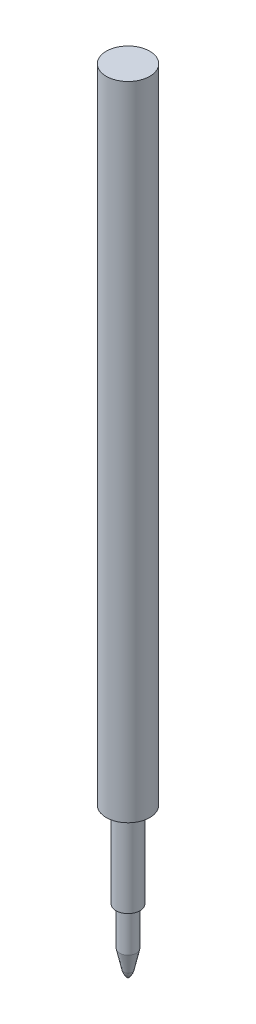
ISO-10303-21;
HEADER;
FILE_DESCRIPTION(('STEP AP214'),'2;1');
FILE_NAME('part.step','',(''),(''),'','','');
FILE_SCHEMA(('AUTOMOTIVE_DESIGN { 1 0 10303 214 1 1 1 1 }'));
ENDSEC;
DATA;
#1=APPLICATION_CONTEXT('core data for automotive mechanical design processes');
#2=APPLICATION_PROTOCOL_DEFINITION('international standard','automotive_design',2000,#1);
#3=PRODUCT_CONTEXT('',#1,'mechanical');
#4=PRODUCT('Part','Part','',(#3));
#5=PRODUCT_RELATED_PRODUCT_CATEGORY('part','',(#4));
#6=PRODUCT_DEFINITION_FORMATION('','',#4);
#7=PRODUCT_DEFINITION_CONTEXT('part definition',#1,'design');
#8=PRODUCT_DEFINITION('design','',#6,#7);
#9=PRODUCT_DEFINITION_SHAPE('','',#8);
#10=(LENGTH_UNIT() NAMED_UNIT(*) SI_UNIT(.MILLI.,.METRE.));
#11=(NAMED_UNIT(*) PLANE_ANGLE_UNIT() SI_UNIT($,.RADIAN.));
#12=(NAMED_UNIT(*) SI_UNIT($,.STERADIAN.) SOLID_ANGLE_UNIT());
#13=UNCERTAINTY_MEASURE_WITH_UNIT(LENGTH_MEASURE(1.E-05),#10,'distance_accuracy_value','');
#14=(GEOMETRIC_REPRESENTATION_CONTEXT(3) GLOBAL_UNCERTAINTY_ASSIGNED_CONTEXT((#13)) GLOBAL_UNIT_ASSIGNED_CONTEXT((#10,
#11,#12)) REPRESENTATION_CONTEXT('',''));
#15=CARTESIAN_POINT('',(0.,0.,0.));
#16=DIRECTION('',(0.,0.,1.));
#17=DIRECTION('',(1.,0.,0.));
#18=AXIS2_PLACEMENT_3D('',#15,#16,#17);
#19=CARTESIAN_POINT('',(0.,1.39695431472081,1.19492385786802));
#20=DIRECTION('',(1.,0.,0.));
#21=DIRECTION('',(0.,0.,-1.));
#22=AXIS2_PLACEMENT_3D('',#19,#20,#21);
#23=CIRCLE('',#22,1.83829387844253);
#24=TRIMMED_CURVE('',#23,(PARAMETER_VALUE(-0.863188384254125)),
(PARAMETER_VALUE(0.863188384254125)),.T.,.PARAMETER.);
#25=CARTESIAN_POINT('',(0.,1.39695431472081,0.));
#26=DIRECTION('',(0.,-1.,0.));
#27=AXIS1_PLACEMENT('',#25,#26);
#28=SURFACE_OF_REVOLUTION('',#24,#27);
#29=CARTESIAN_POINT('',(0.,0.999999999976353,0.));
#30=DIRECTION('',(0.,1.,0.));
#31=DIRECTION('',(0.,0.,1.));
#32=AXIS2_PLACEMENT_3D('',#29,#30,#31);
#33=CIRCLE('',#32,0.600000000005707);
#34=CARTESIAN_POINT('',(0.,0.999999999976353,0.600000000005707));
#35=VERTEX_POINT('',#34);
#36=EDGE_CURVE('E73',#35,#35,#33,.T.);
#37=ORIENTED_EDGE('',*,*,#36,.F.);
#38=EDGE_LOOP('',(#37));
#39=FACE_BOUND('',#38,.T.);
#40=CARTESIAN_POINT('',(0.,0.,0.));
#41=VERTEX_POINT('',#40);
#42=VERTEX_LOOP('',#41);
#43=FACE_BOUND('',#42,.T.);
#44=ADVANCED_FACE('F16',(#39,#43),#28,.F.);
#45=CARTESIAN_POINT('',(0.,3.60000000000582,0.));
#46=DIRECTION('',(0.,1.,0.));
#47=DIRECTION('',(0.,0.,1.));
#48=AXIS2_PLACEMENT_3D('',#45,#46,#47);
#49=CONICAL_SURFACE('',#48,1.17500000001769,0.217650616289047);
#50=ORIENTED_EDGE('',*,*,#36,.T.);
#51=EDGE_LOOP('',(#50));
#52=FACE_BOUND('',#51,.T.);
#53=CARTESIAN_POINT('',(0.,3.6,0.));
#54=DIRECTION('',(0.,-1.,0.));
#55=DIRECTION('',(0.,0.,-1.));
#56=AXIS2_PLACEMENT_3D('',#53,#54,#55);
#57=CIRCLE('',#56,1.175);
#58=CARTESIAN_POINT('',(0.,3.6,-1.175));
#59=VERTEX_POINT('',#58);
#60=EDGE_CURVE('E71',#59,#59,#57,.F.);
#61=ORIENTED_EDGE('',*,*,#60,.F.);
#62=EDGE_LOOP('',(#61));
#63=FACE_BOUND('',#62,.T.);
#64=ADVANCED_FACE('F29',(#52,#63),#49,.T.);
#65=CARTESIAN_POINT('',(0.,0.,0.));
#66=DIRECTION('',(0.,-1.,0.));
#67=DIRECTION('',(0.,0.,-1.));
#68=AXIS2_PLACEMENT_3D('',#65,#66,#67);
#69=CYLINDRICAL_SURFACE('',#68,1.175);
#70=CARTESIAN_POINT('',(0.,9.00000000000001,0.));
#71=DIRECTION('',(0.,-1.,0.));
#72=DIRECTION('',(0.,0.,-1.));
#73=AXIS2_PLACEMENT_3D('',#70,#71,#72);
#74=CIRCLE('',#73,1.175);
#75=CARTESIAN_POINT('',(0.,9.00000000000001,-1.175));
#76=VERTEX_POINT('',#75);
#77=EDGE_CURVE('E20',#76,#76,#74,.F.);
#78=ORIENTED_EDGE('',*,*,#77,.F.);
#79=EDGE_LOOP('',(#78));
#80=FACE_BOUND('',#79,.T.);
#81=ORIENTED_EDGE('',*,*,#60,.T.);
#82=EDGE_LOOP('',(#81));
#83=FACE_BOUND('',#82,.T.);
#84=ADVANCED_FACE('F35',(#80,#83),#69,.T.);
#85=CARTESIAN_POINT('',(1.675,9.00000000000001,0.));
#86=DIRECTION('',(0.,-1.,0.));
#87=DIRECTION('',(0.,0.,-1.));
#88=AXIS2_PLACEMENT_3D('',#85,#86,#87);
#89=PLANE('',#88);
#90=ORIENTED_EDGE('',*,*,#77,.T.);
#91=EDGE_LOOP('',(#90));
#92=FACE_BOUND('',#91,.T.);
#93=CARTESIAN_POINT('',(0.,9.00000000000001,0.));
#94=DIRECTION('',(0.,-1.,0.));
#95=DIRECTION('',(0.,0.,-1.));
#96=AXIS2_PLACEMENT_3D('',#93,#94,#95);
#97=CIRCLE('',#96,1.675);
#98=CARTESIAN_POINT('',(0.,9.00000000000001,-1.675));
#99=VERTEX_POINT('',#98);
#100=EDGE_CURVE('E75',#99,#99,#97,.F.);
#101=ORIENTED_EDGE('',*,*,#100,.F.);
#102=EDGE_LOOP('',(#101));
#103=FACE_BOUND('',#102,.T.);
#104=ADVANCED_FACE('F57',(#92,#103),#89,.T.);
#105=CARTESIAN_POINT('',(0.,0.,0.));
#106=DIRECTION('',(0.,-1.,0.));
#107=DIRECTION('',(0.,0.,-1.));
#108=AXIS2_PLACEMENT_3D('',#105,#106,#107);
#109=CYLINDRICAL_SURFACE('',#108,1.675);
#110=CARTESIAN_POINT('',(0.,21.,0.));
#111=DIRECTION('',(0.,-1.,0.));
#112=DIRECTION('',(0.,0.,-1.));
#113=AXIS2_PLACEMENT_3D('',#110,#111,#112);
#114=CIRCLE('',#113,1.675);
#115=CARTESIAN_POINT('',(0.,21.,-1.675));
#116=VERTEX_POINT('',#115);
#117=EDGE_CURVE('E82',#116,#116,#114,.F.);
#118=ORIENTED_EDGE('',*,*,#117,.F.);
#119=EDGE_LOOP('',(#118));
#120=FACE_BOUND('',#119,.T.);
#121=ORIENTED_EDGE('',*,*,#100,.T.);
#122=EDGE_LOOP('',(#121));
#123=FACE_BOUND('',#122,.T.);
#124=ADVANCED_FACE('F53',(#120,#123),#109,.T.);
#125=CARTESIAN_POINT('',(0.,111.,0.));
#126=DIRECTION('',(0.,1.,0.));
#127=DIRECTION('',(0.,0.,1.));
#128=AXIS2_PLACEMENT_3D('',#125,#126,#127);
#129=PLANE('',#128);
#130=CARTESIAN_POINT('',(0.,111.,0.));
#131=DIRECTION('',(0.,-1.,0.));
#132=DIRECTION('',(0.,0.,-1.));
#133=AXIS2_PLACEMENT_3D('',#130,#131,#132);
#134=CIRCLE('',#133,3.05000000000001);
#135=CARTESIAN_POINT('',(0.,111.,-3.05000000000001));
#136=VERTEX_POINT('',#135);
#137=EDGE_CURVE('E24',#136,#136,#134,.T.);
#138=ORIENTED_EDGE('',*,*,#137,.F.);
#139=EDGE_LOOP('',(#138));
#140=FACE_BOUND('',#139,.T.);
#141=ADVANCED_FACE('F46',(#140),#129,.T.);
#142=CARTESIAN_POINT('',(3.05000000000001,21.,0.));
#143=DIRECTION('',(0.,-1.,0.));
#144=DIRECTION('',(0.,0.,-1.));
#145=AXIS2_PLACEMENT_3D('',#142,#143,#144);
#146=PLANE('',#145);
#147=ORIENTED_EDGE('',*,*,#117,.T.);
#148=EDGE_LOOP('',(#147));
#149=FACE_BOUND('',#148,.T.);
#150=CARTESIAN_POINT('',(0.,21.,0.));
#151=DIRECTION('',(0.,-1.,0.));
#152=DIRECTION('',(0.,0.,-1.));
#153=AXIS2_PLACEMENT_3D('',#150,#151,#152);
#154=CIRCLE('',#153,3.05000000000001);
#155=CARTESIAN_POINT('',(0.,21.,-3.05000000000001));
#156=VERTEX_POINT('',#155);
#157=EDGE_CURVE('E11',#156,#156,#154,.F.);
#158=ORIENTED_EDGE('',*,*,#157,.F.);
#159=EDGE_LOOP('',(#158));
#160=FACE_BOUND('',#159,.T.);
#161=ADVANCED_FACE('F40',(#149,#160),#146,.T.);
#162=CARTESIAN_POINT('',(0.,0.,0.));
#163=DIRECTION('',(0.,-1.,0.));
#164=DIRECTION('',(0.,0.,-1.));
#165=AXIS2_PLACEMENT_3D('',#162,#163,#164);
#166=CYLINDRICAL_SURFACE('',#165,3.05000000000001);
#167=ORIENTED_EDGE('',*,*,#157,.T.);
#168=EDGE_LOOP('',(#167));
#169=FACE_BOUND('',#168,.T.);
#170=ORIENTED_EDGE('',*,*,#137,.T.);
#171=EDGE_LOOP('',(#170));
#172=FACE_BOUND('',#171,.T.);
#173=ADVANCED_FACE('F38',(#169,#172),#166,.T.);
#174=CLOSED_SHELL('',(#44,#64,#84,#104,#124,#141,#161,#173));
#175=MANIFOLD_SOLID_BREP('B1',#174);
#176=ADVANCED_BREP_SHAPE_REPRESENTATION('',(#18,#175),#14);
#177=SHAPE_DEFINITION_REPRESENTATION(#9,#176);
ENDSEC;
END-ISO-10303-21;
